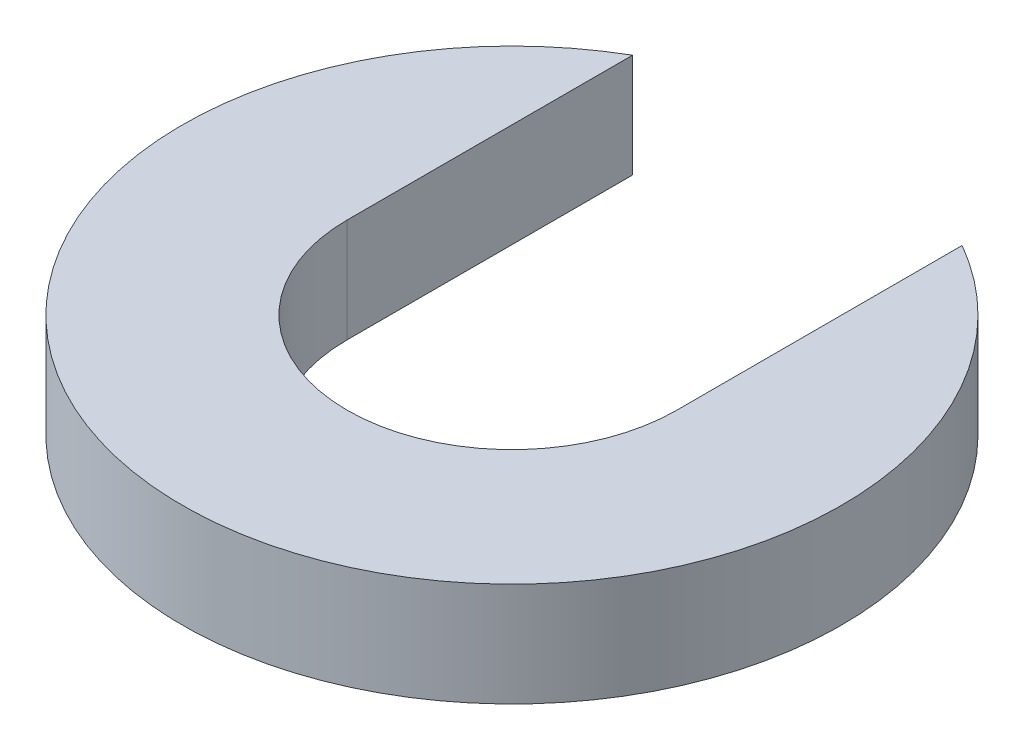
ISO-10303-21;
HEADER;
FILE_DESCRIPTION(('STEP AP214'),'2;1');
FILE_NAME('part.step','',(''),(''),'','','');
FILE_SCHEMA(('AUTOMOTIVE_DESIGN { 1 0 10303 214 1 1 1 1 }'));
ENDSEC;
DATA;
#1=APPLICATION_CONTEXT('core data for automotive mechanical design processes');
#2=APPLICATION_PROTOCOL_DEFINITION('international standard','automotive_design',2000,#1);
#3=PRODUCT_CONTEXT('',#1,'mechanical');
#4=PRODUCT('Part','Part','',(#3));
#5=PRODUCT_RELATED_PRODUCT_CATEGORY('part','',(#4));
#6=PRODUCT_DEFINITION_FORMATION('','',#4);
#7=PRODUCT_DEFINITION_CONTEXT('part definition',#1,'design');
#8=PRODUCT_DEFINITION('design','',#6,#7);
#9=PRODUCT_DEFINITION_SHAPE('','',#8);
#10=(LENGTH_UNIT() NAMED_UNIT(*) SI_UNIT(.MILLI.,.METRE.));
#11=(NAMED_UNIT(*) PLANE_ANGLE_UNIT() SI_UNIT($,.RADIAN.));
#12=(NAMED_UNIT(*) SI_UNIT($,.STERADIAN.) SOLID_ANGLE_UNIT());
#13=UNCERTAINTY_MEASURE_WITH_UNIT(LENGTH_MEASURE(1.E-05),#10,'distance_accuracy_value','');
#14=(GEOMETRIC_REPRESENTATION_CONTEXT(3) GLOBAL_UNCERTAINTY_ASSIGNED_CONTEXT((#13)) GLOBAL_UNIT_ASSIGNED_CONTEXT((#10,
#11,#12)) REPRESENTATION_CONTEXT('',''));
#15=CARTESIAN_POINT('',(0.,0.,0.));
#16=DIRECTION('',(0.,0.,1.));
#17=DIRECTION('',(1.,0.,0.));
#18=AXIS2_PLACEMENT_3D('',#15,#16,#17);
#19=CARTESIAN_POINT('',(0.,3.,0.));
#20=DIRECTION('',(0.,-1.,0.));
#21=DIRECTION('',(0.,0.,-1.));
#22=AXIS2_PLACEMENT_3D('',#19,#20,#21);
#23=CYLINDRICAL_SURFACE('',#22,4.7625);
#24=CARTESIAN_POINT('',(0.,0.,0.));
#25=DIRECTION('',(0.,1.,0.));
#26=DIRECTION('',(0.,0.,1.));
#27=AXIS2_PLACEMENT_3D('',#24,#25,#26);
#28=CIRCLE('',#27,4.7625);
#29=CARTESIAN_POINT('',(-4.7625,0.,0.));
#30=VERTEX_POINT('',#29);
#31=CARTESIAN_POINT('',(4.7625,0.,0.));
#32=VERTEX_POINT('',#31);
#33=EDGE_CURVE('E109',#30,#32,#28,.T.);
#34=ORIENTED_EDGE('',*,*,#33,.F.);
#35=DIRECTION('',(0.,-1.,0.));
#36=VECTOR('',#35,1.);
#37=CARTESIAN_POINT('',(-4.7625,3.,0.));
#38=LINE('',#37,#36);
#39=CARTESIAN_POINT('',(-4.7625,3.,0.));
#40=VERTEX_POINT('',#39);
#41=EDGE_CURVE('E11',#40,#30,#38,.T.);
#42=ORIENTED_EDGE('',*,*,#41,.F.);
#43=CARTESIAN_POINT('',(0.,3.,0.));
#44=DIRECTION('',(0.,1.,0.));
#45=DIRECTION('',(0.,0.,1.));
#46=AXIS2_PLACEMENT_3D('',#43,#44,#45);
#47=CIRCLE('',#46,4.7625);
#48=CARTESIAN_POINT('',(4.7625,3.,0.));
#49=VERTEX_POINT('',#48);
#50=EDGE_CURVE('E90',#40,#49,#47,.T.);
#51=ORIENTED_EDGE('',*,*,#50,.T.);
#52=DIRECTION('',(0.,-1.,0.));
#53=VECTOR('',#52,1.);
#54=CARTESIAN_POINT('',(4.7625,3.,0.));
#55=LINE('',#54,#53);
#56=EDGE_CURVE('E58',#49,#32,#55,.T.);
#57=ORIENTED_EDGE('',*,*,#56,.T.);
#58=EDGE_LOOP('',(#34,#42,#51,#57));
#59=FACE_BOUND('',#58,.T.);
#60=ADVANCED_FACE('F41',(#59),#23,.F.);
#61=CARTESIAN_POINT('',(-4.7625,3.,0.));
#62=DIRECTION('',(-1.,0.,0.));
#63=DIRECTION('',(0.,0.,1.));
#64=AXIS2_PLACEMENT_3D('',#61,#62,#63);
#65=PLANE('',#64);
#66=DIRECTION('',(0.,0.,-1.));
#67=VECTOR('',#66,1.);
#68=CARTESIAN_POINT('',(-4.7625,0.,0.));
#69=LINE('',#68,#67);
#70=CARTESIAN_POINT('',(-4.7625,0.,-8.24889197104678));
#71=VERTEX_POINT('',#70);
#72=EDGE_CURVE('E97',#30,#71,#69,.T.);
#73=ORIENTED_EDGE('',*,*,#72,.T.);
#74=DIRECTION('',(0.,-1.,0.));
#75=VECTOR('',#74,1.);
#76=CARTESIAN_POINT('',(-4.7625,3.,-8.24889197104678));
#77=LINE('',#76,#75);
#78=CARTESIAN_POINT('',(-4.7625,3.,-8.24889197104678));
#79=VERTEX_POINT('',#78);
#80=EDGE_CURVE('E50',#79,#71,#77,.T.);
#81=ORIENTED_EDGE('',*,*,#80,.F.);
#82=DIRECTION('',(0.,0.,-1.));
#83=VECTOR('',#82,1.);
#84=CARTESIAN_POINT('',(-4.7625,3.,0.));
#85=LINE('',#84,#83);
#86=EDGE_CURVE('E84',#40,#79,#85,.T.);
#87=ORIENTED_EDGE('',*,*,#86,.F.);
#88=ORIENTED_EDGE('',*,*,#41,.T.);
#89=EDGE_LOOP('',(#73,#81,#87,#88));
#90=FACE_BOUND('',#89,.T.);
#91=ADVANCED_FACE('F95',(#90),#65,.F.);
#92=CARTESIAN_POINT('',(0.,3.,0.));
#93=DIRECTION('',(0.,-1.,0.));
#94=DIRECTION('',(0.,0.,-1.));
#95=AXIS2_PLACEMENT_3D('',#92,#93,#94);
#96=CYLINDRICAL_SURFACE('',#95,9.525);
#97=CARTESIAN_POINT('',(0.,0.,0.));
#98=DIRECTION('',(0.,1.,0.));
#99=DIRECTION('',(0.,0.,1.));
#100=AXIS2_PLACEMENT_3D('',#97,#98,#99);
#101=CIRCLE('',#100,9.525);
#102=CARTESIAN_POINT('',(4.7625,0.,-8.24889197104678));
#103=VERTEX_POINT('',#102);
#104=EDGE_CURVE('E114',#71,#103,#101,.T.);
#105=ORIENTED_EDGE('',*,*,#104,.T.);
#106=DIRECTION('',(0.,-1.,0.));
#107=VECTOR('',#106,1.);
#108=CARTESIAN_POINT('',(4.7625,3.,-8.24889197104678));
#109=LINE('',#108,#107);
#110=CARTESIAN_POINT('',(4.7625,3.,-8.24889197104678));
#111=VERTEX_POINT('',#110);
#112=EDGE_CURVE('E72',#111,#103,#109,.T.);
#113=ORIENTED_EDGE('',*,*,#112,.F.);
#114=CARTESIAN_POINT('',(0.,3.,0.));
#115=DIRECTION('',(0.,1.,0.));
#116=DIRECTION('',(0.,0.,1.));
#117=AXIS2_PLACEMENT_3D('',#114,#115,#116);
#118=CIRCLE('',#117,9.525);
#119=EDGE_CURVE('E89',#79,#111,#118,.T.);
#120=ORIENTED_EDGE('',*,*,#119,.F.);
#121=ORIENTED_EDGE('',*,*,#80,.T.);
#122=EDGE_LOOP('',(#105,#113,#120,#121));
#123=FACE_BOUND('',#122,.T.);
#124=ADVANCED_FACE('F101',(#123),#96,.T.);
#125=CARTESIAN_POINT('',(4.7625,3.,0.));
#126=DIRECTION('',(-1.,0.,0.));
#127=DIRECTION('',(0.,0.,1.));
#128=AXIS2_PLACEMENT_3D('',#125,#126,#127);
#129=PLANE('',#128);
#130=DIRECTION('',(0.,0.,-1.));
#131=VECTOR('',#130,1.);
#132=CARTESIAN_POINT('',(4.7625,0.,0.));
#133=LINE('',#132,#131);
#134=EDGE_CURVE('E117',#32,#103,#133,.T.);
#135=ORIENTED_EDGE('',*,*,#134,.F.);
#136=ORIENTED_EDGE('',*,*,#56,.F.);
#137=DIRECTION('',(0.,0.,-1.));
#138=VECTOR('',#137,1.);
#139=CARTESIAN_POINT('',(4.7625,3.,0.));
#140=LINE('',#139,#138);
#141=EDGE_CURVE('E103',#49,#111,#140,.T.);
#142=ORIENTED_EDGE('',*,*,#141,.T.);
#143=ORIENTED_EDGE('',*,*,#112,.T.);
#144=EDGE_LOOP('',(#135,#136,#142,#143));
#145=FACE_BOUND('',#144,.T.);
#146=ADVANCED_FACE('F126',(#145),#129,.T.);
#147=CARTESIAN_POINT('',(0.,3.,0.));
#148=DIRECTION('',(0.,1.,0.));
#149=DIRECTION('',(0.,0.,1.));
#150=AXIS2_PLACEMENT_3D('',#147,#148,#149);
#151=PLANE('',#150);
#152=ORIENTED_EDGE('',*,*,#50,.F.);
#153=ORIENTED_EDGE('',*,*,#86,.T.);
#154=ORIENTED_EDGE('',*,*,#119,.T.);
#155=ORIENTED_EDGE('',*,*,#141,.F.);
#156=EDGE_LOOP('',(#152,#153,#154,#155));
#157=FACE_BOUND('',#156,.T.);
#158=ADVANCED_FACE('F86',(#157),#151,.T.);
#159=CARTESIAN_POINT('',(0.,0.,0.));
#160=DIRECTION('',(0.,1.,0.));
#161=DIRECTION('',(0.,0.,1.));
#162=AXIS2_PLACEMENT_3D('',#159,#160,#161);
#163=PLANE('',#162);
#164=ORIENTED_EDGE('',*,*,#33,.T.);
#165=ORIENTED_EDGE('',*,*,#134,.T.);
#166=ORIENTED_EDGE('',*,*,#104,.F.);
#167=ORIENTED_EDGE('',*,*,#72,.F.);
#168=EDGE_LOOP('',(#164,#165,#166,#167));
#169=FACE_BOUND('',#168,.T.);
#170=ADVANCED_FACE('F133',(#169),#163,.F.);
#171=CLOSED_SHELL('',(#60,#91,#124,#146,#158,#170));
#172=MANIFOLD_SOLID_BREP('B2',#171);
#173=ADVANCED_BREP_SHAPE_REPRESENTATION('',(#18,#172),#14);
#174=SHAPE_DEFINITION_REPRESENTATION(#9,#173);
ENDSEC;
END-ISO-10303-21;
